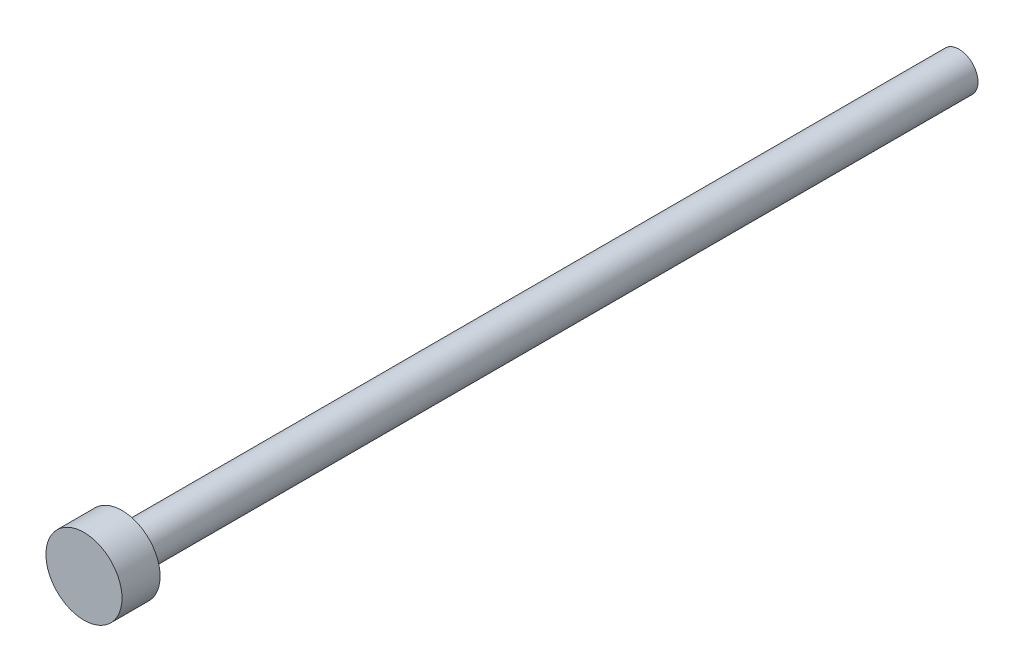
ISO-10303-21;
HEADER;
FILE_DESCRIPTION(('STEP AP214'),'2;1');
FILE_NAME('part.step','',(''),(''),'','','');
FILE_SCHEMA(('AUTOMOTIVE_DESIGN { 1 0 10303 214 1 1 1 1 }'));
ENDSEC;
DATA;
#1=APPLICATION_CONTEXT('core data for automotive mechanical design processes');
#2=APPLICATION_PROTOCOL_DEFINITION('international standard','automotive_design',2000,#1);
#3=PRODUCT_CONTEXT('',#1,'mechanical');
#4=PRODUCT('Part','Part','',(#3));
#5=PRODUCT_RELATED_PRODUCT_CATEGORY('part','',(#4));
#6=PRODUCT_DEFINITION_FORMATION('','',#4);
#7=PRODUCT_DEFINITION_CONTEXT('part definition',#1,'design');
#8=PRODUCT_DEFINITION('design','',#6,#7);
#9=PRODUCT_DEFINITION_SHAPE('','',#8);
#10=(LENGTH_UNIT() NAMED_UNIT(*) SI_UNIT(.MILLI.,.METRE.));
#11=(NAMED_UNIT(*) PLANE_ANGLE_UNIT() SI_UNIT($,.RADIAN.));
#12=(NAMED_UNIT(*) SI_UNIT($,.STERADIAN.) SOLID_ANGLE_UNIT());
#13=UNCERTAINTY_MEASURE_WITH_UNIT(LENGTH_MEASURE(1.E-05),#10,'distance_accuracy_value','');
#14=(GEOMETRIC_REPRESENTATION_CONTEXT(3) GLOBAL_UNCERTAINTY_ASSIGNED_CONTEXT((#13)) GLOBAL_UNIT_ASSIGNED_CONTEXT((#10,
#11,#12)) REPRESENTATION_CONTEXT('',''));
#15=CARTESIAN_POINT('',(0.,0.,0.));
#16=DIRECTION('',(0.,0.,1.));
#17=DIRECTION('',(1.,0.,0.));
#18=AXIS2_PLACEMENT_3D('',#15,#16,#17);
#19=CARTESIAN_POINT('',(0.,0.,22.));
#20=DIRECTION('',(0.,0.,-1.));
#21=DIRECTION('',(-1.,0.,0.));
#22=AXIS2_PLACEMENT_3D('',#19,#20,#21);
#23=CYLINDRICAL_SURFACE('',#22,0.5);
#24=CARTESIAN_POINT('',(0.,0.,22.));
#25=DIRECTION('',(0.,0.,1.));
#26=DIRECTION('',(1.,0.,0.));
#27=AXIS2_PLACEMENT_3D('',#24,#25,#26);
#28=CIRCLE('',#27,0.5);
#29=CARTESIAN_POINT('',(0.5,0.,22.));
#30=VERTEX_POINT('',#29);
#31=EDGE_CURVE('E10',#30,#30,#28,.T.);
#32=ORIENTED_EDGE('',*,*,#31,.F.);
#33=EDGE_LOOP('',(#32));
#34=FACE_BOUND('',#33,.T.);
#35=CARTESIAN_POINT('',(0.,0.,0.));
#36=DIRECTION('',(0.,0.,1.));
#37=DIRECTION('',(1.,0.,0.));
#38=AXIS2_PLACEMENT_3D('',#35,#36,#37);
#39=CIRCLE('',#38,0.5);
#40=CARTESIAN_POINT('',(0.5,0.,0.));
#41=VERTEX_POINT('',#40);
#42=EDGE_CURVE('E33',#41,#41,#39,.T.);
#43=ORIENTED_EDGE('',*,*,#42,.T.);
#44=EDGE_LOOP('',(#43));
#45=FACE_BOUND('',#44,.T.);
#46=ADVANCED_FACE('F30',(#34,#45),#23,.T.);
#47=CARTESIAN_POINT('',(0.,0.,0.));
#48=DIRECTION('',(0.,0.,1.));
#49=DIRECTION('',(1.,0.,0.));
#50=AXIS2_PLACEMENT_3D('',#47,#48,#49);
#51=PLANE('',#50);
#52=ORIENTED_EDGE('',*,*,#42,.F.);
#53=EDGE_LOOP('',(#52));
#54=FACE_BOUND('',#53,.T.);
#55=ADVANCED_FACE('F53',(#54),#51,.F.);
#56=CARTESIAN_POINT('',(0.,0.,23.));
#57=DIRECTION('',(0.,0.,-1.));
#58=DIRECTION('',(-1.,0.,0.));
#59=AXIS2_PLACEMENT_3D('',#56,#57,#58);
#60=CYLINDRICAL_SURFACE('',#59,1.);
#61=CARTESIAN_POINT('',(0.,0.,23.));
#62=DIRECTION('',(0.,0.,1.));
#63=DIRECTION('',(1.,0.,0.));
#64=AXIS2_PLACEMENT_3D('',#61,#62,#63);
#65=CIRCLE('',#64,1.);
#66=CARTESIAN_POINT('',(1.,0.,23.));
#67=VERTEX_POINT('',#66);
#68=EDGE_CURVE('E40',#67,#67,#65,.T.);
#69=ORIENTED_EDGE('',*,*,#68,.F.);
#70=EDGE_LOOP('',(#69));
#71=FACE_BOUND('',#70,.T.);
#72=CARTESIAN_POINT('',(0.,0.,22.));
#73=DIRECTION('',(0.,0.,1.));
#74=DIRECTION('',(1.,0.,0.));
#75=AXIS2_PLACEMENT_3D('',#72,#73,#74);
#76=CIRCLE('',#75,1.);
#77=CARTESIAN_POINT('',(1.,0.,22.));
#78=VERTEX_POINT('',#77);
#79=EDGE_CURVE('E42',#78,#78,#76,.T.);
#80=ORIENTED_EDGE('',*,*,#79,.T.);
#81=EDGE_LOOP('',(#80));
#82=FACE_BOUND('',#81,.T.);
#83=ADVANCED_FACE('F50',(#71,#82),#60,.T.);
#84=CARTESIAN_POINT('',(0.,0.,23.));
#85=DIRECTION('',(0.,0.,1.));
#86=DIRECTION('',(1.,0.,0.));
#87=AXIS2_PLACEMENT_3D('',#84,#85,#86);
#88=PLANE('',#87);
#89=ORIENTED_EDGE('',*,*,#68,.T.);
#90=EDGE_LOOP('',(#89));
#91=FACE_BOUND('',#90,.T.);
#92=ADVANCED_FACE('F48',(#91),#88,.T.);
#93=CARTESIAN_POINT('',(0.,0.,22.));
#94=DIRECTION('',(0.,0.,1.));
#95=DIRECTION('',(1.,0.,0.));
#96=AXIS2_PLACEMENT_3D('',#93,#94,#95);
#97=PLANE('',#96);
#98=ORIENTED_EDGE('',*,*,#31,.T.);
#99=EDGE_LOOP('',(#98));
#100=FACE_BOUND('',#99,.T.);
#101=ORIENTED_EDGE('',*,*,#79,.F.);
#102=EDGE_LOOP('',(#101));
#103=FACE_BOUND('',#102,.T.);
#104=ADVANCED_FACE('F57',(#100,#103),#97,.F.);
#105=CLOSED_SHELL('',(#46,#55,#83,#92,#104));
#106=MANIFOLD_SOLID_BREP('B2',#105);
#107=ADVANCED_BREP_SHAPE_REPRESENTATION('',(#18,#106),#14);
#108=SHAPE_DEFINITION_REPRESENTATION(#9,#107);
ENDSEC;
END-ISO-10303-21;
